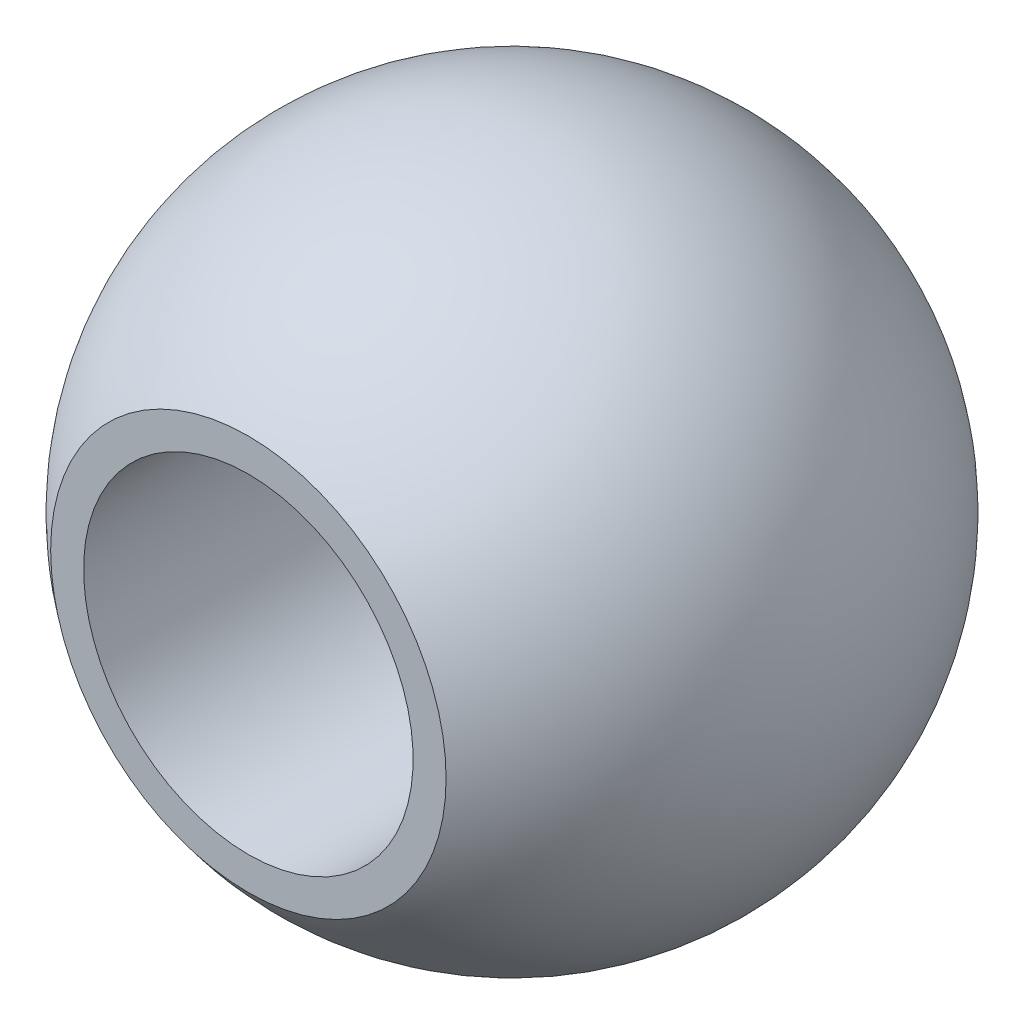
ISO-10303-21;
HEADER;
FILE_DESCRIPTION(('STEP AP214'),'2;1');
FILE_NAME('part.step','',(''),(''),'','','');
FILE_SCHEMA(('AUTOMOTIVE_DESIGN { 1 0 10303 214 1 1 1 1 }'));
ENDSEC;
DATA;
#1=APPLICATION_CONTEXT('core data for automotive mechanical design processes');
#2=APPLICATION_PROTOCOL_DEFINITION('international standard','automotive_design',2000,#1);
#3=PRODUCT_CONTEXT('',#1,'mechanical');
#4=PRODUCT('Part','Part','',(#3));
#5=PRODUCT_RELATED_PRODUCT_CATEGORY('part','',(#4));
#6=PRODUCT_DEFINITION_FORMATION('','',#4);
#7=PRODUCT_DEFINITION_CONTEXT('part definition',#1,'design');
#8=PRODUCT_DEFINITION('design','',#6,#7);
#9=PRODUCT_DEFINITION_SHAPE('','',#8);
#10=(LENGTH_UNIT() NAMED_UNIT(*) SI_UNIT(.MILLI.,.METRE.));
#11=(NAMED_UNIT(*) PLANE_ANGLE_UNIT() SI_UNIT($,.RADIAN.));
#12=(NAMED_UNIT(*) SI_UNIT($,.STERADIAN.) SOLID_ANGLE_UNIT());
#13=UNCERTAINTY_MEASURE_WITH_UNIT(LENGTH_MEASURE(1.E-05),#10,'distance_accuracy_value','');
#14=(GEOMETRIC_REPRESENTATION_CONTEXT(3) GLOBAL_UNCERTAINTY_ASSIGNED_CONTEXT((#13)) GLOBAL_UNIT_ASSIGNED_CONTEXT((#10,
#11,#12)) REPRESENTATION_CONTEXT('',''));
#15=CARTESIAN_POINT('',(0.,0.,0.));
#16=DIRECTION('',(0.,0.,1.));
#17=DIRECTION('',(1.,0.,0.));
#18=AXIS2_PLACEMENT_3D('',#15,#16,#17);
#19=CARTESIAN_POINT('',(0.,0.,10.));
#20=DIRECTION('',(0.,0.,-1.));
#21=DIRECTION('',(-1.,0.,0.));
#22=AXIS2_PLACEMENT_3D('',#19,#20,#21);
#23=CYLINDRICAL_SURFACE('',#22,2.5);
#24=CARTESIAN_POINT('',(0.,0.,-4.));
#25=DIRECTION('',(0.,0.,-1.));
#26=DIRECTION('',(0.,1.,0.));
#27=AXIS2_PLACEMENT_3D('',#24,#25,#26);
#28=CIRCLE('',#27,2.5);
#29=CARTESIAN_POINT('',(0.,2.5,-4.));
#30=VERTEX_POINT('',#29);
#31=EDGE_CURVE('E47',#30,#30,#28,.T.);
#32=ORIENTED_EDGE('',*,*,#31,.T.);
#33=EDGE_LOOP('',(#32));
#34=FACE_BOUND('',#33,.T.);
#35=CARTESIAN_POINT('',(0.,0.,4.));
#36=DIRECTION('',(0.,0.,1.));
#37=DIRECTION('',(0.,-1.,0.));
#38=AXIS2_PLACEMENT_3D('',#35,#36,#37);
#39=CIRCLE('',#38,2.5);
#40=CARTESIAN_POINT('',(0.,-2.5,4.));
#41=VERTEX_POINT('',#40);
#42=EDGE_CURVE('E37',#41,#41,#39,.T.);
#43=ORIENTED_EDGE('',*,*,#42,.T.);
#44=EDGE_LOOP('',(#43));
#45=FACE_BOUND('',#44,.T.);
#46=ADVANCED_FACE('F33',(#34,#45),#23,.F.);
#47=CARTESIAN_POINT('',(10.,5.31522867682553,-4.));
#48=DIRECTION('',(0.,0.,-1.));
#49=DIRECTION('',(0.,1.,0.));
#50=AXIS2_PLACEMENT_3D('',#47,#48,#49);
#51=PLANE('',#50);
#52=CARTESIAN_POINT('',(0.,0.,-4.));
#53=DIRECTION('',(0.,0.,-1.));
#54=DIRECTION('',(0.,1.,0.));
#55=AXIS2_PLACEMENT_3D('',#52,#53,#54);
#56=CIRCLE('',#55,3.);
#57=CARTESIAN_POINT('',(0.,3.,-4.));
#58=VERTEX_POINT('',#57);
#59=EDGE_CURVE('E45',#58,#58,#56,.F.);
#60=ORIENTED_EDGE('',*,*,#59,.F.);
#61=EDGE_LOOP('',(#60));
#62=FACE_BOUND('',#61,.T.);
#63=ORIENTED_EDGE('',*,*,#31,.F.);
#64=EDGE_LOOP('',(#63));
#65=FACE_BOUND('',#64,.T.);
#66=ADVANCED_FACE('F55',(#62,#65),#51,.T.);
#67=CARTESIAN_POINT('',(10.,5.31522867682553,4.));
#68=DIRECTION('',(0.,0.,1.));
#69=DIRECTION('',(0.,-1.,0.));
#70=AXIS2_PLACEMENT_3D('',#67,#68,#69);
#71=PLANE('',#70);
#72=CARTESIAN_POINT('',(0.,0.,4.));
#73=DIRECTION('',(0.,0.,1.));
#74=DIRECTION('',(0.,-1.,0.));
#75=AXIS2_PLACEMENT_3D('',#72,#73,#74);
#76=CIRCLE('',#75,3.);
#77=CARTESIAN_POINT('',(0.,-3.,4.));
#78=VERTEX_POINT('',#77);
#79=EDGE_CURVE('E10',#78,#78,#76,.F.);
#80=ORIENTED_EDGE('',*,*,#79,.F.);
#81=EDGE_LOOP('',(#80));
#82=FACE_BOUND('',#81,.T.);
#83=ORIENTED_EDGE('',*,*,#42,.F.);
#84=EDGE_LOOP('',(#83));
#85=FACE_BOUND('',#84,.T.);
#86=ADVANCED_FACE('F58',(#82,#85),#71,.T.);
#87=CARTESIAN_POINT('',(0.,0.,0.));
#88=DIRECTION('',(0.,1.,0.));
#89=DIRECTION('',(1.,0.,0.));
#90=AXIS2_PLACEMENT_3D('',#87,#88,#89);
#91=SPHERICAL_SURFACE('',#90,5.);
#92=CARTESIAN_POINT('',(0.,0.,0.));
#93=DIRECTION('',(0.,0.,-1.));
#94=DIRECTION('',(0.,1.,0.));
#95=AXIS2_PLACEMENT_3D('',#92,#93,#94);
#96=SPHERICAL_SURFACE('',#95,5.);
#97=ORIENTED_EDGE('',*,*,#59,.T.);
#98=EDGE_LOOP('',(#97));
#99=FACE_BOUND('',#98,.T.);
#100=ORIENTED_EDGE('',*,*,#79,.T.);
#101=EDGE_LOOP('',(#100));
#102=FACE_BOUND('',#101,.T.);
#103=ADVANCED_FACE('F35',(#99,#102),#96,.T.);
#104=CLOSED_SHELL('',(#46,#66,#86,#103));
#105=MANIFOLD_SOLID_BREP('B2',#104);
#106=ADVANCED_BREP_SHAPE_REPRESENTATION('',(#18,#105),#14);
#107=SHAPE_DEFINITION_REPRESENTATION(#9,#106);
ENDSEC;
END-ISO-10303-21;
